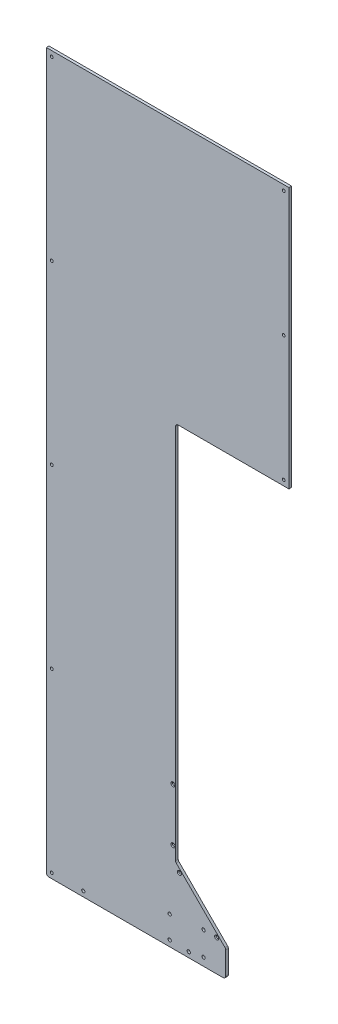
ISO-10303-21;
HEADER;
FILE_DESCRIPTION(('STEP AP214'),'2;1');
FILE_NAME('part.step','',(''),(''),'','','');
FILE_SCHEMA(('AUTOMOTIVE_DESIGN { 1 0 10303 214 1 1 1 1 }'));
ENDSEC;
DATA;
#1=APPLICATION_CONTEXT('core data for automotive mechanical design processes');
#2=APPLICATION_PROTOCOL_DEFINITION('international standard','automotive_design',2000,#1);
#3=PRODUCT_CONTEXT('',#1,'mechanical');
#4=PRODUCT('Part','Part','',(#3));
#5=PRODUCT_RELATED_PRODUCT_CATEGORY('part','',(#4));
#6=PRODUCT_DEFINITION_FORMATION('','',#4);
#7=PRODUCT_DEFINITION_CONTEXT('part definition',#1,'design');
#8=PRODUCT_DEFINITION('design','',#6,#7);
#9=PRODUCT_DEFINITION_SHAPE('','',#8);
#10=(LENGTH_UNIT() NAMED_UNIT(*) SI_UNIT(.MILLI.,.METRE.));
#11=(NAMED_UNIT(*) PLANE_ANGLE_UNIT() SI_UNIT($,.RADIAN.));
#12=(NAMED_UNIT(*) SI_UNIT($,.STERADIAN.) SOLID_ANGLE_UNIT());
#13=UNCERTAINTY_MEASURE_WITH_UNIT(LENGTH_MEASURE(1.E-05),#10,'distance_accuracy_value','');
#14=(GEOMETRIC_REPRESENTATION_CONTEXT(3) GLOBAL_UNCERTAINTY_ASSIGNED_CONTEXT((#13)) GLOBAL_UNIT_ASSIGNED_CONTEXT((#10,
#11,#12)) REPRESENTATION_CONTEXT('',''));
#15=CARTESIAN_POINT('',(0.,0.,0.));
#16=DIRECTION('',(0.,0.,1.));
#17=DIRECTION('',(1.,0.,0.));
#18=AXIS2_PLACEMENT_3D('',#15,#16,#17);
#19=CARTESIAN_POINT('',(0.,0.,6.35));
#20=DIRECTION('',(0.,0.,-1.));
#21=DIRECTION('',(-1.,0.,0.));
#22=AXIS2_PLACEMENT_3D('',#19,#20,#21);
#23=PLANE('',#22);
#24=CARTESIAN_POINT('',(296.8625,14.2875,6.35));
#25=DIRECTION('',(0.,0.,1.));
#26=DIRECTION('',(1.,0.,0.));
#27=AXIS2_PLACEMENT_3D('',#24,#25,#26);
#28=CIRCLE('',#27,3.96874999999997);
#29=CARTESIAN_POINT('',(300.83125,14.2875,6.35));
#30=VERTEX_POINT('',#29);
#31=EDGE_CURVE('E824',#30,#30,#28,.T.);
#32=ORIENTED_EDGE('',*,*,#31,.F.);
#33=EDGE_LOOP('',(#32));
#34=FACE_BOUND('',#33,.T.);
#35=CARTESIAN_POINT('',(378.46762,76.2,6.35));
#36=DIRECTION('',(0.,0.,-1.));
#37=DIRECTION('',(-1.,0.,0.));
#38=AXIS2_PLACEMENT_3D('',#35,#36,#37);
#39=CIRCLE('',#38,3.937);
#40=CARTESIAN_POINT('',(374.53062,76.2,6.35));
#41=VERTEX_POINT('',#40);
#42=EDGE_CURVE('E739',#41,#41,#39,.T.);
#43=ORIENTED_EDGE('',*,*,#42,.T.);
#44=EDGE_LOOP('',(#43));
#45=FACE_BOUND('',#44,.T.);
#46=CARTESIAN_POINT('',(378.46762,19.05,6.35));
#47=DIRECTION('',(0.,0.,-1.));
#48=DIRECTION('',(-1.,0.,0.));
#49=AXIS2_PLACEMENT_3D('',#46,#47,#48);
#50=CIRCLE('',#49,3.937);
#51=CARTESIAN_POINT('',(374.53062,19.05,6.35));
#52=VERTEX_POINT('',#51);
#53=EDGE_CURVE('E732',#52,#52,#50,.T.);
#54=ORIENTED_EDGE('',*,*,#53,.T.);
#55=EDGE_LOOP('',(#54));
#56=FACE_BOUND('',#55,.T.);
#57=CARTESIAN_POINT('',(304.8,342.9,6.35));
#58=DIRECTION('',(0.,0.,1.));
#59=DIRECTION('',(1.,0.,0.));
#60=AXIS2_PLACEMENT_3D('',#57,#58,#59);
#61=CIRCLE('',#60,4.88949999999999);
#62=CARTESIAN_POINT('',(309.6895,342.9,6.35));
#63=VERTEX_POINT('',#62);
#64=EDGE_CURVE('E742',#63,#63,#61,.T.);
#65=ORIENTED_EDGE('',*,*,#64,.F.);
#66=EDGE_LOOP('',(#65));
#67=FACE_BOUND('',#66,.T.);
#68=CARTESIAN_POINT('',(410.11974387893,76.2,6.35));
#69=DIRECTION('',(0.,0.,1.));
#70=DIRECTION('',(1.,0.,0.));
#71=AXIS2_PLACEMENT_3D('',#68,#69,#70);
#72=CIRCLE('',#71,4.88949999999999);
#73=CARTESIAN_POINT('',(415.00924387893,76.2,6.35));
#74=VERTEX_POINT('',#73);
#75=EDGE_CURVE('E766',#74,#74,#72,.T.);
#76=ORIENTED_EDGE('',*,*,#75,.F.);
#77=EDGE_LOOP('',(#76));
#78=FACE_BOUND('',#77,.T.);
#79=CARTESIAN_POINT('',(88.9,12.7,6.35));
#80=DIRECTION('',(0.,0.,1.));
#81=DIRECTION('',(1.,0.,0.));
#82=AXIS2_PLACEMENT_3D('',#79,#80,#81);
#83=CIRCLE('',#82,3.96875);
#84=CARTESIAN_POINT('',(92.86875,12.7,6.35));
#85=VERTEX_POINT('',#84);
#86=EDGE_CURVE('E211',#85,#85,#83,.T.);
#87=ORIENTED_EDGE('',*,*,#86,.F.);
#88=EDGE_LOOP('',(#87));
#89=FACE_BOUND('',#88,.T.);
#90=CARTESIAN_POINT('',(342.9,12.7,6.35));
#91=DIRECTION('',(0.,0.,1.));
#92=DIRECTION('',(1.,0.,0.));
#93=AXIS2_PLACEMENT_3D('',#90,#91,#92);
#94=CIRCLE('',#93,3.96875000000005);
#95=CARTESIAN_POINT('',(346.86875,12.7,6.35));
#96=VERTEX_POINT('',#95);
#97=EDGE_CURVE('E217',#96,#96,#94,.T.);
#98=ORIENTED_EDGE('',*,*,#97,.F.);
#99=EDGE_LOOP('',(#98));
#100=FACE_BOUND('',#99,.T.);
#101=CARTESIAN_POINT('',(12.7,1714.5,6.35));
#102=DIRECTION('',(0.,0.,1.));
#103=DIRECTION('',(1.,0.,0.));
#104=AXIS2_PLACEMENT_3D('',#101,#102,#103);
#105=CIRCLE('',#104,3.37819999999999);
#106=CARTESIAN_POINT('',(16.0782,1714.5,6.35));
#107=VERTEX_POINT('',#106);
#108=EDGE_CURVE('E215',#107,#107,#105,.T.);
#109=ORIENTED_EDGE('',*,*,#108,.F.);
#110=EDGE_LOOP('',(#109));
#111=FACE_BOUND('',#110,.T.);
#112=CARTESIAN_POINT('',(12.7,1289.05,6.35));
#113=DIRECTION('',(0.,0.,1.));
#114=DIRECTION('',(1.,0.,0.));
#115=AXIS2_PLACEMENT_3D('',#112,#113,#114);
#116=CIRCLE('',#115,3.37819999999999);
#117=CARTESIAN_POINT('',(16.0782,1289.05,6.35));
#118=VERTEX_POINT('',#117);
#119=EDGE_CURVE('E232',#118,#118,#116,.T.);
#120=ORIENTED_EDGE('',*,*,#119,.F.);
#121=EDGE_LOOP('',(#120));
#122=FACE_BOUND('',#121,.T.);
#123=CARTESIAN_POINT('',(12.7,863.6,6.35));
#124=DIRECTION('',(0.,0.,1.));
#125=DIRECTION('',(1.,0.,0.));
#126=AXIS2_PLACEMENT_3D('',#123,#124,#125);
#127=CIRCLE('',#126,3.37819999999999);
#128=CARTESIAN_POINT('',(16.0782,863.6,6.35));
#129=VERTEX_POINT('',#128);
#130=EDGE_CURVE('E238',#129,#129,#127,.T.);
#131=ORIENTED_EDGE('',*,*,#130,.F.);
#132=EDGE_LOOP('',(#131));
#133=FACE_BOUND('',#132,.T.);
#134=CARTESIAN_POINT('',(12.7,438.15,6.35));
#135=DIRECTION('',(0.,0.,1.));
#136=DIRECTION('',(1.,0.,0.));
#137=AXIS2_PLACEMENT_3D('',#134,#135,#136);
#138=CIRCLE('',#137,3.37819999999999);
#139=CARTESIAN_POINT('',(16.0782,438.15,6.35));
#140=VERTEX_POINT('',#139);
#141=EDGE_CURVE('E244',#140,#140,#138,.T.);
#142=ORIENTED_EDGE('',*,*,#141,.F.);
#143=EDGE_LOOP('',(#142));
#144=FACE_BOUND('',#143,.T.);
#145=CARTESIAN_POINT('',(12.7,12.7,6.35));
#146=DIRECTION('',(0.,0.,1.));
#147=DIRECTION('',(1.,0.,0.));
#148=AXIS2_PLACEMENT_3D('',#145,#146,#147);
#149=CIRCLE('',#148,3.37819999999999);
#150=CARTESIAN_POINT('',(16.0782,12.7,6.35));
#151=VERTEX_POINT('',#150);
#152=EDGE_CURVE('E250',#151,#151,#149,.T.);
#153=ORIENTED_EDGE('',*,*,#152,.F.);
#154=EDGE_LOOP('',(#153));
#155=FACE_BOUND('',#154,.T.);
#156=CARTESIAN_POINT('',(571.5,1111.25,6.35));
#157=DIRECTION('',(0.,0.,1.));
#158=DIRECTION('',(1.,0.,0.));
#159=AXIS2_PLACEMENT_3D('',#156,#157,#158);
#160=CIRCLE('',#159,3.3782);
#161=CARTESIAN_POINT('',(574.8782,1111.25,6.35));
#162=VERTEX_POINT('',#161);
#163=EDGE_CURVE('E256',#162,#162,#160,.T.);
#164=ORIENTED_EDGE('',*,*,#163,.F.);
#165=EDGE_LOOP('',(#164));
#166=FACE_BOUND('',#165,.T.);
#167=CARTESIAN_POINT('',(571.5,1412.875,6.35));
#168=DIRECTION('',(0.,0.,1.));
#169=DIRECTION('',(1.,0.,0.));
#170=AXIS2_PLACEMENT_3D('',#167,#168,#169);
#171=CIRCLE('',#170,3.3782);
#172=CARTESIAN_POINT('',(574.8782,1412.875,6.35));
#173=VERTEX_POINT('',#172);
#174=EDGE_CURVE('E262',#173,#173,#171,.T.);
#175=ORIENTED_EDGE('',*,*,#174,.F.);
#176=EDGE_LOOP('',(#175));
#177=FACE_BOUND('',#176,.T.);
#178=CARTESIAN_POINT('',(571.5,1714.5,6.35));
#179=DIRECTION('',(0.,0.,1.));
#180=DIRECTION('',(1.,0.,0.));
#181=AXIS2_PLACEMENT_3D('',#178,#179,#180);
#182=CIRCLE('',#181,3.3782);
#183=CARTESIAN_POINT('',(574.8782,1714.5,6.35));
#184=VERTEX_POINT('',#183);
#185=EDGE_CURVE('E268',#184,#184,#182,.T.);
#186=ORIENTED_EDGE('',*,*,#185,.F.);
#187=EDGE_LOOP('',(#186));
#188=FACE_BOUND('',#187,.T.);
#189=DIRECTION('',(0.,-1.,0.));
#190=VECTOR('',#189,1.);
#191=CARTESIAN_POINT('',(0.,0.,6.35));
#192=LINE('',#191,#190);
#193=CARTESIAN_POINT('',(0.,1727.2,6.35));
#194=VERTEX_POINT('',#193);
#195=CARTESIAN_POINT('',(0.,6.35,6.35));
#196=VERTEX_POINT('',#195);
#197=EDGE_CURVE('E158',#194,#196,#192,.T.);
#198=ORIENTED_EDGE('',*,*,#197,.T.);
#199=CARTESIAN_POINT('',(6.35,6.35,6.35));
#200=DIRECTION('',(0.,0.,-1.));
#201=DIRECTION('',(-1.,0.,0.));
#202=AXIS2_PLACEMENT_3D('',#199,#200,#201);
#203=CIRCLE('',#202,6.35);
#204=CARTESIAN_POINT('',(6.35,0.,6.35));
#205=VERTEX_POINT('',#204);
#206=EDGE_CURVE('E188',#196,#205,#203,.F.);
#207=ORIENTED_EDGE('',*,*,#206,.T.);
#208=DIRECTION('',(1.,0.,0.));
#209=VECTOR('',#208,1.);
#210=CARTESIAN_POINT('',(0.,0.,6.35));
#211=LINE('',#210,#209);
#212=CARTESIAN_POINT('',(425.45,0.,6.35));
#213=VERTEX_POINT('',#212);
#214=EDGE_CURVE('E292',#205,#213,#211,.T.);
#215=ORIENTED_EDGE('',*,*,#214,.T.);
#216=CARTESIAN_POINT('',(425.45,6.35,6.35));
#217=DIRECTION('',(0.,0.,-1.));
#218=DIRECTION('',(-1.,0.,0.));
#219=AXIS2_PLACEMENT_3D('',#216,#217,#218);
#220=CIRCLE('',#219,6.35);
#221=CARTESIAN_POINT('',(431.8,6.35,6.35));
#222=VERTEX_POINT('',#221);
#223=EDGE_CURVE('E186',#213,#222,#220,.F.);
#224=ORIENTED_EDGE('',*,*,#223,.T.);
#225=DIRECTION('',(0.,-1.,0.));
#226=VECTOR('',#225,1.);
#227=CARTESIAN_POINT('',(431.8,63.5,6.35));
#228=LINE('',#227,#226);
#229=CARTESIAN_POINT('',(431.8,60.8697438789308,6.35));
#230=VERTEX_POINT('',#229);
#231=EDGE_CURVE('E138',#230,#222,#228,.T.);
#232=ORIENTED_EDGE('',*,*,#231,.F.);
#233=CARTESIAN_POINT('',(425.45,60.8697438789308,6.35));
#234=DIRECTION('',(0.,0.,-1.));
#235=DIRECTION('',(-1.,0.,0.));
#236=AXIS2_PLACEMENT_3D('',#233,#234,#235);
#237=CIRCLE('',#236,6.35);
#238=CARTESIAN_POINT('',(429.940128060535,65.3598719394654,6.35));
#239=VERTEX_POINT('',#238);
#240=EDGE_CURVE('E184',#230,#239,#237,.F.);
#241=ORIENTED_EDGE('',*,*,#240,.T.);
#242=DIRECTION('',(0.70710678118655,-0.707106781186545,0.));
#243=VECTOR('',#242,1.);
#244=CARTESIAN_POINT('',(311.15,184.149999999999,6.35));
#245=LINE('',#244,#243);
#246=CARTESIAN_POINT('',(313.009871939466,182.290128060534,6.35));
#247=VERTEX_POINT('',#246);
#248=EDGE_CURVE('E285',#247,#239,#245,.T.);
#249=ORIENTED_EDGE('',*,*,#248,.F.);
#250=CARTESIAN_POINT('',(317.5,186.780256121068,6.35));
#251=DIRECTION('',(0.,0.,-1.));
#252=DIRECTION('',(-1.,0.,0.));
#253=AXIS2_PLACEMENT_3D('',#250,#251,#252);
#254=CIRCLE('',#253,6.35);
#255=CARTESIAN_POINT('',(311.15,186.780256121068,6.35));
#256=VERTEX_POINT('',#255);
#257=EDGE_CURVE('E56',#247,#256,#254,.T.);
#258=ORIENTED_EDGE('',*,*,#257,.T.);
#259=DIRECTION('',(0.,-1.,0.));
#260=VECTOR('',#259,1.);
#261=CARTESIAN_POINT('',(311.15,1098.55,6.35));
#262=LINE('',#261,#260);
#263=CARTESIAN_POINT('',(311.15,1092.2,6.35));
#264=VERTEX_POINT('',#263);
#265=EDGE_CURVE('E283',#264,#256,#262,.T.);
#266=ORIENTED_EDGE('',*,*,#265,.F.);
#267=CARTESIAN_POINT('',(317.5,1092.2,6.35));
#268=DIRECTION('',(0.,0.,-1.));
#269=DIRECTION('',(-1.,0.,0.));
#270=AXIS2_PLACEMENT_3D('',#267,#268,#269);
#271=CIRCLE('',#270,6.35);
#272=CARTESIAN_POINT('',(317.5,1098.55,6.35));
#273=VERTEX_POINT('',#272);
#274=EDGE_CURVE('E43',#264,#273,#271,.T.);
#275=ORIENTED_EDGE('',*,*,#274,.T.);
#276=DIRECTION('',(-1.,0.,0.));
#277=VECTOR('',#276,1.);
#278=CARTESIAN_POINT('',(584.2,1098.55,6.35));
#279=LINE('',#278,#277);
#280=CARTESIAN_POINT('',(584.2,1098.55,6.35));
#281=VERTEX_POINT('',#280);
#282=EDGE_CURVE('E273',#281,#273,#279,.T.);
#283=ORIENTED_EDGE('',*,*,#282,.F.);
#284=DIRECTION('',(0.,1.,0.));
#285=VECTOR('',#284,1.);
#286=CARTESIAN_POINT('',(584.2,0.,6.35));
#287=LINE('',#286,#285);
#288=CARTESIAN_POINT('',(584.2,1727.2,6.35));
#289=VERTEX_POINT('',#288);
#290=EDGE_CURVE('E146',#281,#289,#287,.T.);
#291=ORIENTED_EDGE('',*,*,#290,.T.);
#292=DIRECTION('',(-1.,0.,0.));
#293=VECTOR('',#292,1.);
#294=CARTESIAN_POINT('',(0.,1727.2,6.35));
#295=LINE('',#294,#293);
#296=EDGE_CURVE('E168',#289,#194,#295,.T.);
#297=ORIENTED_EDGE('',*,*,#296,.T.);
#298=EDGE_LOOP('',(#198,#207,#215,#224,#232,#241,#249,#258,#266,#275,#283,#291,#297));
#299=FACE_BOUND('',#298,.T.);
#300=CARTESIAN_POINT('',(320.317182668239,166.002561210692,6.35));
#301=DIRECTION('',(0.,0.,1.));
#302=DIRECTION('',(1.,0.,0.));
#303=AXIS2_PLACEMENT_3D('',#300,#301,#302);
#304=CIRCLE('',#303,4.88949999999999);
#305=CARTESIAN_POINT('',(325.206682668239,166.002561210692,6.35));
#306=VERTEX_POINT('',#305);
#307=EDGE_CURVE('E759',#306,#306,#304,.T.);
#308=ORIENTED_EDGE('',*,*,#307,.F.);
#309=EDGE_LOOP('',(#308));
#310=FACE_BOUND('',#309,.T.);
#311=CARTESIAN_POINT('',(304.8,215.9,6.35));
#312=DIRECTION('',(0.,0.,1.));
#313=DIRECTION('',(1.,0.,0.));
#314=AXIS2_PLACEMENT_3D('',#311,#312,#313);
#315=CIRCLE('',#314,4.88949999999999);
#316=CARTESIAN_POINT('',(309.6895,215.9,6.35));
#317=VERTEX_POINT('',#316);
#318=EDGE_CURVE('E752',#317,#317,#315,.T.);
#319=ORIENTED_EDGE('',*,*,#318,.F.);
#320=EDGE_LOOP('',(#319));
#321=FACE_BOUND('',#320,.T.);
#322=CARTESIAN_POINT('',(296.8625,68.2625,6.35));
#323=DIRECTION('',(0.,0.,1.));
#324=DIRECTION('',(1.,0.,0.));
#325=AXIS2_PLACEMENT_3D('',#322,#323,#324);
#326=CIRCLE('',#325,3.96874999999997);
#327=CARTESIAN_POINT('',(300.83125,68.2625,6.35));
#328=VERTEX_POINT('',#327);
#329=EDGE_CURVE('E730',#328,#328,#326,.T.);
#330=ORIENTED_EDGE('',*,*,#329,.F.);
#331=EDGE_LOOP('',(#330));
#332=FACE_BOUND('',#331,.T.);
#333=ADVANCED_FACE('F34',(#34,#45,#56,#67,#78,#89,#100,#111,#122,#133,#144,#155,#166,#177,#188,
#299,#310,#321,#332),#23,.F.);
#334=CARTESIAN_POINT('',(0.,0.,0.));
#335=DIRECTION('',(0.,0.,-1.));
#336=DIRECTION('',(-1.,0.,0.));
#337=AXIS2_PLACEMENT_3D('',#334,#335,#336);
#338=PLANE('',#337);
#339=CARTESIAN_POINT('',(296.8625,14.2875,0.));
#340=DIRECTION('',(0.,0.,1.));
#341=DIRECTION('',(1.,0.,0.));
#342=AXIS2_PLACEMENT_3D('',#339,#340,#341);
#343=CIRCLE('',#342,3.96874999999997);
#344=CARTESIAN_POINT('',(300.83125,14.2875,0.));
#345=VERTEX_POINT('',#344);
#346=EDGE_CURVE('E735',#345,#345,#343,.T.);
#347=ORIENTED_EDGE('',*,*,#346,.T.);
#348=EDGE_LOOP('',(#347));
#349=FACE_BOUND('',#348,.T.);
#350=DIRECTION('',(1.,0.,0.));
#351=VECTOR('',#350,1.);
#352=CARTESIAN_POINT('',(0.,0.,0.));
#353=LINE('',#352,#351);
#354=CARTESIAN_POINT('',(6.35,0.,0.));
#355=VERTEX_POINT('',#354);
#356=CARTESIAN_POINT('',(425.45,0.,0.));
#357=VERTEX_POINT('',#356);
#358=EDGE_CURVE('E156',#355,#357,#353,.T.);
#359=ORIENTED_EDGE('',*,*,#358,.F.);
#360=CARTESIAN_POINT('',(6.35,6.35,0.));
#361=DIRECTION('',(0.,0.,-1.));
#362=DIRECTION('',(-1.,0.,0.));
#363=AXIS2_PLACEMENT_3D('',#360,#361,#362);
#364=CIRCLE('',#363,6.35);
#365=CARTESIAN_POINT('',(0.,6.35,0.));
#366=VERTEX_POINT('',#365);
#367=EDGE_CURVE('E180',#355,#366,#364,.T.);
#368=ORIENTED_EDGE('',*,*,#367,.T.);
#369=DIRECTION('',(0.,-1.,0.));
#370=VECTOR('',#369,1.);
#371=CARTESIAN_POINT('',(0.,0.,0.));
#372=LINE('',#371,#370);
#373=CARTESIAN_POINT('',(0.,1727.2,0.));
#374=VERTEX_POINT('',#373);
#375=EDGE_CURVE('E147',#374,#366,#372,.T.);
#376=ORIENTED_EDGE('',*,*,#375,.F.);
#377=DIRECTION('',(-1.,0.,0.));
#378=VECTOR('',#377,1.);
#379=CARTESIAN_POINT('',(0.,1727.2,0.));
#380=LINE('',#379,#378);
#381=CARTESIAN_POINT('',(584.2,1727.2,0.));
#382=VERTEX_POINT('',#381);
#383=EDGE_CURVE('E155',#382,#374,#380,.T.);
#384=ORIENTED_EDGE('',*,*,#383,.F.);
#385=DIRECTION('',(0.,1.,0.));
#386=VECTOR('',#385,1.);
#387=CARTESIAN_POINT('',(584.2,0.,0.));
#388=LINE('',#387,#386);
#389=CARTESIAN_POINT('',(584.2,1098.55,0.));
#390=VERTEX_POINT('',#389);
#391=EDGE_CURVE('E144',#390,#382,#388,.T.);
#392=ORIENTED_EDGE('',*,*,#391,.F.);
#393=DIRECTION('',(-1.,0.,0.));
#394=VECTOR('',#393,1.);
#395=CARTESIAN_POINT('',(584.2,1098.55,0.));
#396=LINE('',#395,#394);
#397=CARTESIAN_POINT('',(317.5,1098.55,0.));
#398=VERTEX_POINT('',#397);
#399=EDGE_CURVE('E128',#390,#398,#396,.T.);
#400=ORIENTED_EDGE('',*,*,#399,.T.);
#401=CARTESIAN_POINT('',(317.5,1092.2,0.));
#402=DIRECTION('',(0.,0.,-1.));
#403=DIRECTION('',(-1.,0.,0.));
#404=AXIS2_PLACEMENT_3D('',#401,#402,#403);
#405=CIRCLE('',#404,6.35);
#406=CARTESIAN_POINT('',(311.15,1092.2,0.));
#407=VERTEX_POINT('',#406);
#408=EDGE_CURVE('E11',#398,#407,#405,.F.);
#409=ORIENTED_EDGE('',*,*,#408,.T.);
#410=DIRECTION('',(0.,-1.,0.));
#411=VECTOR('',#410,1.);
#412=CARTESIAN_POINT('',(311.15,1098.55,0.));
#413=LINE('',#412,#411);
#414=CARTESIAN_POINT('',(311.15,186.780256121068,0.));
#415=VERTEX_POINT('',#414);
#416=EDGE_CURVE('E137',#407,#415,#413,.T.);
#417=ORIENTED_EDGE('',*,*,#416,.T.);
#418=CARTESIAN_POINT('',(317.5,186.780256121068,0.));
#419=DIRECTION('',(0.,0.,-1.));
#420=DIRECTION('',(-1.,0.,0.));
#421=AXIS2_PLACEMENT_3D('',#418,#419,#420);
#422=CIRCLE('',#421,6.35);
#423=CARTESIAN_POINT('',(313.009871939466,182.290128060534,0.));
#424=VERTEX_POINT('',#423);
#425=EDGE_CURVE('E207',#415,#424,#422,.F.);
#426=ORIENTED_EDGE('',*,*,#425,.T.);
#427=DIRECTION('',(0.70710678118655,-0.707106781186545,0.));
#428=VECTOR('',#427,1.);
#429=CARTESIAN_POINT('',(311.15,184.149999999999,0.));
#430=LINE('',#429,#428);
#431=CARTESIAN_POINT('',(429.940128060535,65.3598719394654,0.));
#432=VERTEX_POINT('',#431);
#433=EDGE_CURVE('E277',#424,#432,#430,.T.);
#434=ORIENTED_EDGE('',*,*,#433,.T.);
#435=CARTESIAN_POINT('',(425.45,60.8697438789308,0.));
#436=DIRECTION('',(0.,0.,-1.));
#437=DIRECTION('',(-1.,0.,0.));
#438=AXIS2_PLACEMENT_3D('',#435,#436,#437);
#439=CIRCLE('',#438,6.35);
#440=CARTESIAN_POINT('',(431.8,60.8697438789308,0.));
#441=VERTEX_POINT('',#440);
#442=EDGE_CURVE('E176',#432,#441,#439,.T.);
#443=ORIENTED_EDGE('',*,*,#442,.T.);
#444=DIRECTION('',(0.,-1.,0.));
#445=VECTOR('',#444,1.);
#446=CARTESIAN_POINT('',(431.8,63.5,0.));
#447=LINE('',#446,#445);
#448=CARTESIAN_POINT('',(431.8,6.35,0.));
#449=VERTEX_POINT('',#448);
#450=EDGE_CURVE('E148',#441,#449,#447,.T.);
#451=ORIENTED_EDGE('',*,*,#450,.T.);
#452=CARTESIAN_POINT('',(425.45,6.35,0.));
#453=DIRECTION('',(0.,0.,-1.));
#454=DIRECTION('',(-1.,0.,0.));
#455=AXIS2_PLACEMENT_3D('',#452,#453,#454);
#456=CIRCLE('',#455,6.35);
#457=EDGE_CURVE('E178',#449,#357,#456,.T.);
#458=ORIENTED_EDGE('',*,*,#457,.T.);
#459=EDGE_LOOP('',(#359,#368,#376,#384,#392,#400,#409,#417,#426,#434,#443,#451,#458));
#460=FACE_BOUND('',#459,.T.);
#461=CARTESIAN_POINT('',(571.5,1714.5,0.));
#462=DIRECTION('',(0.,0.,1.));
#463=DIRECTION('',(1.,0.,0.));
#464=AXIS2_PLACEMENT_3D('',#461,#462,#463);
#465=CIRCLE('',#464,3.3782);
#466=CARTESIAN_POINT('',(574.8782,1714.5,0.));
#467=VERTEX_POINT('',#466);
#468=EDGE_CURVE('E271',#467,#467,#465,.T.);
#469=ORIENTED_EDGE('',*,*,#468,.T.);
#470=EDGE_LOOP('',(#469));
#471=FACE_BOUND('',#470,.T.);
#472=CARTESIAN_POINT('',(571.5,1412.875,0.));
#473=DIRECTION('',(0.,0.,1.));
#474=DIRECTION('',(1.,0.,0.));
#475=AXIS2_PLACEMENT_3D('',#472,#473,#474);
#476=CIRCLE('',#475,3.3782);
#477=CARTESIAN_POINT('',(574.8782,1412.875,0.));
#478=VERTEX_POINT('',#477);
#479=EDGE_CURVE('E265',#478,#478,#476,.T.);
#480=ORIENTED_EDGE('',*,*,#479,.T.);
#481=EDGE_LOOP('',(#480));
#482=FACE_BOUND('',#481,.T.);
#483=CARTESIAN_POINT('',(571.5,1111.25,0.));
#484=DIRECTION('',(0.,0.,1.));
#485=DIRECTION('',(1.,0.,0.));
#486=AXIS2_PLACEMENT_3D('',#483,#484,#485);
#487=CIRCLE('',#486,3.3782);
#488=CARTESIAN_POINT('',(574.8782,1111.25,0.));
#489=VERTEX_POINT('',#488);
#490=EDGE_CURVE('E259',#489,#489,#487,.T.);
#491=ORIENTED_EDGE('',*,*,#490,.T.);
#492=EDGE_LOOP('',(#491));
#493=FACE_BOUND('',#492,.T.);
#494=CARTESIAN_POINT('',(12.7,12.7,0.));
#495=DIRECTION('',(0.,0.,1.));
#496=DIRECTION('',(1.,0.,0.));
#497=AXIS2_PLACEMENT_3D('',#494,#495,#496);
#498=CIRCLE('',#497,3.37819999999999);
#499=CARTESIAN_POINT('',(16.0782,12.7,0.));
#500=VERTEX_POINT('',#499);
#501=EDGE_CURVE('E253',#500,#500,#498,.T.);
#502=ORIENTED_EDGE('',*,*,#501,.T.);
#503=EDGE_LOOP('',(#502));
#504=FACE_BOUND('',#503,.T.);
#505=CARTESIAN_POINT('',(12.7,438.15,0.));
#506=DIRECTION('',(0.,0.,1.));
#507=DIRECTION('',(1.,0.,0.));
#508=AXIS2_PLACEMENT_3D('',#505,#506,#507);
#509=CIRCLE('',#508,3.37819999999999);
#510=CARTESIAN_POINT('',(16.0782,438.15,0.));
#511=VERTEX_POINT('',#510);
#512=EDGE_CURVE('E247',#511,#511,#509,.T.);
#513=ORIENTED_EDGE('',*,*,#512,.T.);
#514=EDGE_LOOP('',(#513));
#515=FACE_BOUND('',#514,.T.);
#516=CARTESIAN_POINT('',(12.7,863.6,0.));
#517=DIRECTION('',(0.,0.,1.));
#518=DIRECTION('',(1.,0.,0.));
#519=AXIS2_PLACEMENT_3D('',#516,#517,#518);
#520=CIRCLE('',#519,3.37819999999999);
#521=CARTESIAN_POINT('',(16.0782,863.6,0.));
#522=VERTEX_POINT('',#521);
#523=EDGE_CURVE('E241',#522,#522,#520,.T.);
#524=ORIENTED_EDGE('',*,*,#523,.T.);
#525=EDGE_LOOP('',(#524));
#526=FACE_BOUND('',#525,.T.);
#527=CARTESIAN_POINT('',(12.7,1289.05,0.));
#528=DIRECTION('',(0.,0.,1.));
#529=DIRECTION('',(1.,0.,0.));
#530=AXIS2_PLACEMENT_3D('',#527,#528,#529);
#531=CIRCLE('',#530,3.37819999999999);
#532=CARTESIAN_POINT('',(16.0782,1289.05,0.));
#533=VERTEX_POINT('',#532);
#534=EDGE_CURVE('E235',#533,#533,#531,.T.);
#535=ORIENTED_EDGE('',*,*,#534,.T.);
#536=EDGE_LOOP('',(#535));
#537=FACE_BOUND('',#536,.T.);
#538=CARTESIAN_POINT('',(12.7,1714.5,0.));
#539=DIRECTION('',(0.,0.,1.));
#540=DIRECTION('',(1.,0.,0.));
#541=AXIS2_PLACEMENT_3D('',#538,#539,#540);
#542=CIRCLE('',#541,3.37819999999999);
#543=CARTESIAN_POINT('',(16.0782,1714.5,0.));
#544=VERTEX_POINT('',#543);
#545=EDGE_CURVE('E229',#544,#544,#542,.T.);
#546=ORIENTED_EDGE('',*,*,#545,.T.);
#547=EDGE_LOOP('',(#546));
#548=FACE_BOUND('',#547,.T.);
#549=CARTESIAN_POINT('',(342.9,12.7,0.));
#550=DIRECTION('',(0.,0.,-1.));
#551=DIRECTION('',(-1.,0.,0.));
#552=AXIS2_PLACEMENT_3D('',#549,#550,#551);
#553=CIRCLE('',#552,3.96875000000005);
#554=CARTESIAN_POINT('',(338.93125,12.7,0.));
#555=VERTEX_POINT('',#554);
#556=EDGE_CURVE('E209',#555,#555,#553,.T.);
#557=ORIENTED_EDGE('',*,*,#556,.F.);
#558=EDGE_LOOP('',(#557));
#559=FACE_BOUND('',#558,.T.);
#560=CARTESIAN_POINT('',(88.9,12.7,0.));
#561=DIRECTION('',(0.,0.,-1.));
#562=DIRECTION('',(-1.,0.,0.));
#563=AXIS2_PLACEMENT_3D('',#560,#561,#562);
#564=CIRCLE('',#563,3.96875);
#565=CARTESIAN_POINT('',(84.93125,12.7,0.));
#566=VERTEX_POINT('',#565);
#567=EDGE_CURVE('E38',#566,#566,#564,.T.);
#568=ORIENTED_EDGE('',*,*,#567,.F.);
#569=EDGE_LOOP('',(#568));
#570=FACE_BOUND('',#569,.T.);
#571=CARTESIAN_POINT('',(410.11974387893,76.2,0.));
#572=DIRECTION('',(0.,0.,-1.));
#573=DIRECTION('',(-1.,0.,0.));
#574=AXIS2_PLACEMENT_3D('',#571,#572,#573);
#575=CIRCLE('',#574,2.8067);
#576=CARTESIAN_POINT('',(407.31304387893,76.2,0.));
#577=VERTEX_POINT('',#576);
#578=EDGE_CURVE('E222',#577,#577,#575,.T.);
#579=ORIENTED_EDGE('',*,*,#578,.F.);
#580=EDGE_LOOP('',(#579));
#581=FACE_BOUND('',#580,.T.);
#582=CARTESIAN_POINT('',(320.317182668239,166.002561210692,0.));
#583=DIRECTION('',(0.,0.,-1.));
#584=DIRECTION('',(-1.,0.,0.));
#585=AXIS2_PLACEMENT_3D('',#582,#583,#584);
#586=CIRCLE('',#585,2.8067);
#587=CARTESIAN_POINT('',(317.510482668239,166.002561210692,0.));
#588=VERTEX_POINT('',#587);
#589=EDGE_CURVE('E710',#588,#588,#586,.T.);
#590=ORIENTED_EDGE('',*,*,#589,.F.);
#591=EDGE_LOOP('',(#590));
#592=FACE_BOUND('',#591,.T.);
#593=CARTESIAN_POINT('',(304.8,215.9,0.));
#594=DIRECTION('',(0.,0.,-1.));
#595=DIRECTION('',(-1.,0.,0.));
#596=AXIS2_PLACEMENT_3D('',#593,#594,#595);
#597=CIRCLE('',#596,2.8067);
#598=CARTESIAN_POINT('',(301.9933,215.9,0.));
#599=VERTEX_POINT('',#598);
#600=EDGE_CURVE('E714',#599,#599,#597,.T.);
#601=ORIENTED_EDGE('',*,*,#600,.F.);
#602=EDGE_LOOP('',(#601));
#603=FACE_BOUND('',#602,.T.);
#604=CARTESIAN_POINT('',(304.8,342.9,0.));
#605=DIRECTION('',(0.,0.,-1.));
#606=DIRECTION('',(-1.,0.,0.));
#607=AXIS2_PLACEMENT_3D('',#604,#605,#606);
#608=CIRCLE('',#607,2.8067);
#609=CARTESIAN_POINT('',(301.9933,342.9,0.));
#610=VERTEX_POINT('',#609);
#611=EDGE_CURVE('E718',#610,#610,#608,.T.);
#612=ORIENTED_EDGE('',*,*,#611,.F.);
#613=EDGE_LOOP('',(#612));
#614=FACE_BOUND('',#613,.T.);
#615=CARTESIAN_POINT('',(378.46762,19.05,0.));
#616=DIRECTION('',(0.,0.,-1.));
#617=DIRECTION('',(-1.,0.,0.));
#618=AXIS2_PLACEMENT_3D('',#615,#616,#617);
#619=CIRCLE('',#618,3.937);
#620=CARTESIAN_POINT('',(374.53062,19.05,0.));
#621=VERTEX_POINT('',#620);
#622=EDGE_CURVE('E722',#621,#621,#619,.T.);
#623=ORIENTED_EDGE('',*,*,#622,.F.);
#624=EDGE_LOOP('',(#623));
#625=FACE_BOUND('',#624,.T.);
#626=CARTESIAN_POINT('',(378.46762,76.2,0.));
#627=DIRECTION('',(0.,0.,-1.));
#628=DIRECTION('',(-1.,0.,0.));
#629=AXIS2_PLACEMENT_3D('',#626,#627,#628);
#630=CIRCLE('',#629,3.937);
#631=CARTESIAN_POINT('',(374.53062,76.2,0.));
#632=VERTEX_POINT('',#631);
#633=EDGE_CURVE('E726',#632,#632,#630,.T.);
#634=ORIENTED_EDGE('',*,*,#633,.F.);
#635=EDGE_LOOP('',(#634));
#636=FACE_BOUND('',#635,.T.);
#637=CARTESIAN_POINT('',(296.8625,68.2625,0.));
#638=DIRECTION('',(0.,0.,1.));
#639=DIRECTION('',(1.,0.,0.));
#640=AXIS2_PLACEMENT_3D('',#637,#638,#639);
#641=CIRCLE('',#640,3.96874999999997);
#642=CARTESIAN_POINT('',(300.83125,68.2625,0.));
#643=VERTEX_POINT('',#642);
#644=EDGE_CURVE('E729',#643,#643,#641,.T.);
#645=ORIENTED_EDGE('',*,*,#644,.T.);
#646=EDGE_LOOP('',(#645));
#647=FACE_BOUND('',#646,.T.);
#648=ADVANCED_FACE('F152',(#349,#460,#471,#482,#493,#504,#515,#526,#537,#548,#559,#570,#581,
#592,#603,#614,#625,#636,#647),#338,.T.);
#649=CARTESIAN_POINT('',(0.,0.,6.35));
#650=DIRECTION('',(1.,0.,0.));
#651=DIRECTION('',(0.,0.,-1.));
#652=AXIS2_PLACEMENT_3D('',#649,#650,#651);
#653=PLANE('',#652);
#654=ORIENTED_EDGE('',*,*,#375,.T.);
#655=DIRECTION('',(0.,0.,-1.));
#656=VECTOR('',#655,1.);
#657=CARTESIAN_POINT('',(0.,6.35,6.35));
#658=LINE('',#657,#656);
#659=EDGE_CURVE('E182',#366,#196,#658,.F.);
#660=ORIENTED_EDGE('',*,*,#659,.T.);
#661=ORIENTED_EDGE('',*,*,#197,.F.);
#662=DIRECTION('',(0.,0.,-1.));
#663=VECTOR('',#662,1.);
#664=CARTESIAN_POINT('',(0.,1727.2,6.35));
#665=LINE('',#664,#663);
#666=EDGE_CURVE('E164',#194,#374,#665,.T.);
#667=ORIENTED_EDGE('',*,*,#666,.T.);
#668=EDGE_LOOP('',(#654,#660,#661,#667));
#669=FACE_BOUND('',#668,.T.);
#670=ADVANCED_FACE('F299',(#669),#653,.F.);
#671=CARTESIAN_POINT('',(0.,0.,6.35));
#672=DIRECTION('',(0.,1.,0.));
#673=DIRECTION('',(0.,0.,1.));
#674=AXIS2_PLACEMENT_3D('',#671,#672,#673);
#675=PLANE('',#674);
#676=ORIENTED_EDGE('',*,*,#214,.F.);
#677=DIRECTION('',(0.,0.,-1.));
#678=VECTOR('',#677,1.);
#679=CARTESIAN_POINT('',(6.35,0.,6.35));
#680=LINE('',#679,#678);
#681=EDGE_CURVE('E173',#205,#355,#680,.T.);
#682=ORIENTED_EDGE('',*,*,#681,.T.);
#683=ORIENTED_EDGE('',*,*,#358,.T.);
#684=DIRECTION('',(0.,0.,1.));
#685=VECTOR('',#684,1.);
#686=CARTESIAN_POINT('',(425.45,0.,6.35));
#687=LINE('',#686,#685);
#688=EDGE_CURVE('E170',#357,#213,#687,.T.);
#689=ORIENTED_EDGE('',*,*,#688,.T.);
#690=EDGE_LOOP('',(#676,#682,#683,#689));
#691=FACE_BOUND('',#690,.T.);
#692=ADVANCED_FACE('F309',(#691),#675,.F.);
#693=CARTESIAN_POINT('',(584.2,0.,6.35));
#694=DIRECTION('',(-1.,0.,0.));
#695=DIRECTION('',(0.,0.,1.));
#696=AXIS2_PLACEMENT_3D('',#693,#694,#695);
#697=PLANE('',#696);
#698=ORIENTED_EDGE('',*,*,#290,.F.);
#699=DIRECTION('',(0.,0.,1.));
#700=VECTOR('',#699,1.);
#701=CARTESIAN_POINT('',(584.2,1098.55,0.));
#702=LINE('',#701,#700);
#703=EDGE_CURVE('E131',#390,#281,#702,.T.);
#704=ORIENTED_EDGE('',*,*,#703,.F.);
#705=ORIENTED_EDGE('',*,*,#391,.T.);
#706=DIRECTION('',(0.,0.,-1.));
#707=VECTOR('',#706,1.);
#708=CARTESIAN_POINT('',(584.2,1727.2,6.35));
#709=LINE('',#708,#707);
#710=EDGE_CURVE('E167',#289,#382,#709,.T.);
#711=ORIENTED_EDGE('',*,*,#710,.F.);
#712=EDGE_LOOP('',(#698,#704,#705,#711));
#713=FACE_BOUND('',#712,.T.);
#714=ADVANCED_FACE('F142',(#713),#697,.F.);
#715=CARTESIAN_POINT('',(0.,1727.2,6.35));
#716=DIRECTION('',(0.,-1.,0.));
#717=DIRECTION('',(0.,0.,-1.));
#718=AXIS2_PLACEMENT_3D('',#715,#716,#717);
#719=PLANE('',#718);
#720=ORIENTED_EDGE('',*,*,#383,.T.);
#721=ORIENTED_EDGE('',*,*,#666,.F.);
#722=ORIENTED_EDGE('',*,*,#296,.F.);
#723=ORIENTED_EDGE('',*,*,#710,.T.);
#724=EDGE_LOOP('',(#720,#721,#722,#723));
#725=FACE_BOUND('',#724,.T.);
#726=ADVANCED_FACE('F358',(#725),#719,.F.);
#727=CARTESIAN_POINT('',(431.8,63.5,0.));
#728=DIRECTION('',(-1.,0.,0.));
#729=DIRECTION('',(0.,0.,1.));
#730=AXIS2_PLACEMENT_3D('',#727,#728,#729);
#731=PLANE('',#730);
#732=ORIENTED_EDGE('',*,*,#231,.T.);
#733=DIRECTION('',(0.,0.,1.));
#734=VECTOR('',#733,1.);
#735=CARTESIAN_POINT('',(431.8,6.35,0.));
#736=LINE('',#735,#734);
#737=EDGE_CURVE('E193',#222,#449,#736,.F.);
#738=ORIENTED_EDGE('',*,*,#737,.T.);
#739=ORIENTED_EDGE('',*,*,#450,.F.);
#740=DIRECTION('',(0.,0.,1.));
#741=VECTOR('',#740,1.);
#742=CARTESIAN_POINT('',(431.8,60.8697438789308,0.));
#743=LINE('',#742,#741);
#744=EDGE_CURVE('E190',#441,#230,#743,.T.);
#745=ORIENTED_EDGE('',*,*,#744,.T.);
#746=EDGE_LOOP('',(#732,#738,#739,#745));
#747=FACE_BOUND('',#746,.T.);
#748=ADVANCED_FACE('F317',(#747),#731,.F.);
#749=CARTESIAN_POINT('',(311.15,184.149999999999,0.));
#750=DIRECTION('',(-0.707106781186545,-0.707106781186549,0.));
#751=DIRECTION('',(0.70710678118655,-0.707106781186545,0.));
#752=AXIS2_PLACEMENT_3D('',#749,#750,#751);
#753=PLANE('',#752);
#754=ORIENTED_EDGE('',*,*,#248,.T.);
#755=DIRECTION('',(0.,0.,1.));
#756=VECTOR('',#755,1.);
#757=CARTESIAN_POINT('',(429.940128060535,65.3598719394654,0.));
#758=LINE('',#757,#756);
#759=EDGE_CURVE('E198',#239,#432,#758,.F.);
#760=ORIENTED_EDGE('',*,*,#759,.T.);
#761=ORIENTED_EDGE('',*,*,#433,.F.);
#762=DIRECTION('',(0.,0.,1.));
#763=VECTOR('',#762,1.);
#764=CARTESIAN_POINT('',(313.009871939466,182.290128060534,6.35));
#765=LINE('',#764,#763);
#766=EDGE_CURVE('E195',#424,#247,#765,.T.);
#767=ORIENTED_EDGE('',*,*,#766,.T.);
#768=EDGE_LOOP('',(#754,#760,#761,#767));
#769=FACE_BOUND('',#768,.T.);
#770=ADVANCED_FACE('F325',(#769),#753,.F.);
#771=CARTESIAN_POINT('',(311.15,1098.55,0.));
#772=DIRECTION('',(-1.,0.,0.));
#773=DIRECTION('',(0.,-1.,0.));
#774=AXIS2_PLACEMENT_3D('',#771,#772,#773);
#775=PLANE('',#774);
#776=ORIENTED_EDGE('',*,*,#265,.T.);
#777=DIRECTION('',(0.,0.,1.));
#778=VECTOR('',#777,1.);
#779=CARTESIAN_POINT('',(311.15,186.780256121068,0.));
#780=LINE('',#779,#778);
#781=EDGE_CURVE('E203',#256,#415,#780,.F.);
#782=ORIENTED_EDGE('',*,*,#781,.T.);
#783=ORIENTED_EDGE('',*,*,#416,.F.);
#784=DIRECTION('',(0.,0.,1.));
#785=VECTOR('',#784,1.);
#786=CARTESIAN_POINT('',(311.15,1092.2,6.35));
#787=LINE('',#786,#785);
#788=EDGE_CURVE('E200',#407,#264,#787,.T.);
#789=ORIENTED_EDGE('',*,*,#788,.T.);
#790=EDGE_LOOP('',(#776,#782,#783,#789));
#791=FACE_BOUND('',#790,.T.);
#792=ADVANCED_FACE('F334',(#791),#775,.F.);
#793=CARTESIAN_POINT('',(584.2,1098.55,0.));
#794=DIRECTION('',(0.,1.,0.));
#795=DIRECTION('',(0.,0.,1.));
#796=AXIS2_PLACEMENT_3D('',#793,#794,#795);
#797=PLANE('',#796);
#798=ORIENTED_EDGE('',*,*,#282,.T.);
#799=DIRECTION('',(0.,0.,1.));
#800=VECTOR('',#799,1.);
#801=CARTESIAN_POINT('',(317.5,1098.55,0.));
#802=LINE('',#801,#800);
#803=EDGE_CURVE('E133',#273,#398,#802,.F.);
#804=ORIENTED_EDGE('',*,*,#803,.T.);
#805=ORIENTED_EDGE('',*,*,#399,.F.);
#806=ORIENTED_EDGE('',*,*,#703,.T.);
#807=EDGE_LOOP('',(#798,#804,#805,#806));
#808=FACE_BOUND('',#807,.T.);
#809=ADVANCED_FACE('F130',(#808),#797,.F.);
#810=CARTESIAN_POINT('',(571.5,1714.5,6.35));
#811=DIRECTION('',(0.,0.,1.));
#812=DIRECTION('',(1.,0.,0.));
#813=AXIS2_PLACEMENT_3D('',#810,#811,#812);
#814=CYLINDRICAL_SURFACE('',#813,3.3782);
#815=ORIENTED_EDGE('',*,*,#468,.F.);
#816=EDGE_LOOP('',(#815));
#817=FACE_BOUND('',#816,.T.);
#818=ORIENTED_EDGE('',*,*,#185,.T.);
#819=EDGE_LOOP('',(#818));
#820=FACE_BOUND('',#819,.T.);
#821=ADVANCED_FACE('F564',(#817,#820),#814,.F.);
#822=CARTESIAN_POINT('',(571.5,1412.875,6.35));
#823=DIRECTION('',(0.,0.,1.));
#824=DIRECTION('',(1.,0.,0.));
#825=AXIS2_PLACEMENT_3D('',#822,#823,#824);
#826=CYLINDRICAL_SURFACE('',#825,3.3782);
#827=ORIENTED_EDGE('',*,*,#479,.F.);
#828=EDGE_LOOP('',(#827));
#829=FACE_BOUND('',#828,.T.);
#830=ORIENTED_EDGE('',*,*,#174,.T.);
#831=EDGE_LOOP('',(#830));
#832=FACE_BOUND('',#831,.T.);
#833=ADVANCED_FACE('F560',(#829,#832),#826,.F.);
#834=CARTESIAN_POINT('',(571.5,1111.25,6.35));
#835=DIRECTION('',(0.,0.,1.));
#836=DIRECTION('',(1.,0.,0.));
#837=AXIS2_PLACEMENT_3D('',#834,#835,#836);
#838=CYLINDRICAL_SURFACE('',#837,3.3782);
#839=ORIENTED_EDGE('',*,*,#490,.F.);
#840=EDGE_LOOP('',(#839));
#841=FACE_BOUND('',#840,.T.);
#842=ORIENTED_EDGE('',*,*,#163,.T.);
#843=EDGE_LOOP('',(#842));
#844=FACE_BOUND('',#843,.T.);
#845=ADVANCED_FACE('F556',(#841,#844),#838,.F.);
#846=CARTESIAN_POINT('',(12.7,12.7,6.35));
#847=DIRECTION('',(0.,0.,1.));
#848=DIRECTION('',(1.,0.,0.));
#849=AXIS2_PLACEMENT_3D('',#846,#847,#848);
#850=CYLINDRICAL_SURFACE('',#849,3.37819999999999);
#851=ORIENTED_EDGE('',*,*,#501,.F.);
#852=EDGE_LOOP('',(#851));
#853=FACE_BOUND('',#852,.T.);
#854=ORIENTED_EDGE('',*,*,#152,.T.);
#855=EDGE_LOOP('',(#854));
#856=FACE_BOUND('',#855,.T.);
#857=ADVANCED_FACE('F552',(#853,#856),#850,.F.);
#858=CARTESIAN_POINT('',(12.7,438.15,6.35));
#859=DIRECTION('',(0.,0.,1.));
#860=DIRECTION('',(1.,0.,0.));
#861=AXIS2_PLACEMENT_3D('',#858,#859,#860);
#862=CYLINDRICAL_SURFACE('',#861,3.37819999999999);
#863=ORIENTED_EDGE('',*,*,#512,.F.);
#864=EDGE_LOOP('',(#863));
#865=FACE_BOUND('',#864,.T.);
#866=ORIENTED_EDGE('',*,*,#141,.T.);
#867=EDGE_LOOP('',(#866));
#868=FACE_BOUND('',#867,.T.);
#869=ADVANCED_FACE('F548',(#865,#868),#862,.F.);
#870=CARTESIAN_POINT('',(12.7,863.6,6.35));
#871=DIRECTION('',(0.,0.,1.));
#872=DIRECTION('',(1.,0.,0.));
#873=AXIS2_PLACEMENT_3D('',#870,#871,#872);
#874=CYLINDRICAL_SURFACE('',#873,3.37819999999999);
#875=ORIENTED_EDGE('',*,*,#523,.F.);
#876=EDGE_LOOP('',(#875));
#877=FACE_BOUND('',#876,.T.);
#878=ORIENTED_EDGE('',*,*,#130,.T.);
#879=EDGE_LOOP('',(#878));
#880=FACE_BOUND('',#879,.T.);
#881=ADVANCED_FACE('F544',(#877,#880),#874,.F.);
#882=CARTESIAN_POINT('',(12.7,1289.05,6.35));
#883=DIRECTION('',(0.,0.,1.));
#884=DIRECTION('',(1.,0.,0.));
#885=AXIS2_PLACEMENT_3D('',#882,#883,#884);
#886=CYLINDRICAL_SURFACE('',#885,3.37819999999999);
#887=ORIENTED_EDGE('',*,*,#534,.F.);
#888=EDGE_LOOP('',(#887));
#889=FACE_BOUND('',#888,.T.);
#890=ORIENTED_EDGE('',*,*,#119,.T.);
#891=EDGE_LOOP('',(#890));
#892=FACE_BOUND('',#891,.T.);
#893=ADVANCED_FACE('F540',(#889,#892),#886,.F.);
#894=CARTESIAN_POINT('',(12.7,1714.5,6.35));
#895=DIRECTION('',(0.,0.,1.));
#896=DIRECTION('',(1.,0.,0.));
#897=AXIS2_PLACEMENT_3D('',#894,#895,#896);
#898=CYLINDRICAL_SURFACE('',#897,3.37819999999999);
#899=ORIENTED_EDGE('',*,*,#545,.F.);
#900=EDGE_LOOP('',(#899));
#901=FACE_BOUND('',#900,.T.);
#902=ORIENTED_EDGE('',*,*,#108,.T.);
#903=EDGE_LOOP('',(#902));
#904=FACE_BOUND('',#903,.T.);
#905=ADVANCED_FACE('F370',(#901,#904),#898,.F.);
#906=CARTESIAN_POINT('',(6.35,6.35,6.35));
#907=DIRECTION('',(0.,0.,-1.));
#908=DIRECTION('',(-1.,0.,0.));
#909=AXIS2_PLACEMENT_3D('',#906,#907,#908);
#910=CYLINDRICAL_SURFACE('',#909,6.35);
#911=ORIENTED_EDGE('',*,*,#206,.F.);
#912=ORIENTED_EDGE('',*,*,#659,.F.);
#913=ORIENTED_EDGE('',*,*,#367,.F.);
#914=ORIENTED_EDGE('',*,*,#681,.F.);
#915=EDGE_LOOP('',(#911,#912,#913,#914));
#916=FACE_BOUND('',#915,.T.);
#917=ADVANCED_FACE('F304',(#916),#910,.T.);
#918=CARTESIAN_POINT('',(425.45,6.35,6.35));
#919=DIRECTION('',(0.,0.,1.));
#920=DIRECTION('',(1.,0.,0.));
#921=AXIS2_PLACEMENT_3D('',#918,#919,#920);
#922=CYLINDRICAL_SURFACE('',#921,6.35);
#923=ORIENTED_EDGE('',*,*,#457,.F.);
#924=ORIENTED_EDGE('',*,*,#737,.F.);
#925=ORIENTED_EDGE('',*,*,#223,.F.);
#926=ORIENTED_EDGE('',*,*,#688,.F.);
#927=EDGE_LOOP('',(#923,#924,#925,#926));
#928=FACE_BOUND('',#927,.T.);
#929=ADVANCED_FACE('F313',(#928),#922,.T.);
#930=CARTESIAN_POINT('',(425.45,60.8697438789308,0.));
#931=DIRECTION('',(0.,0.,1.));
#932=DIRECTION('',(1.,0.,0.));
#933=AXIS2_PLACEMENT_3D('',#930,#931,#932);
#934=CYLINDRICAL_SURFACE('',#933,6.35);
#935=ORIENTED_EDGE('',*,*,#442,.F.);
#936=ORIENTED_EDGE('',*,*,#759,.F.);
#937=ORIENTED_EDGE('',*,*,#240,.F.);
#938=ORIENTED_EDGE('',*,*,#744,.F.);
#939=EDGE_LOOP('',(#935,#936,#937,#938));
#940=FACE_BOUND('',#939,.T.);
#941=ADVANCED_FACE('F322',(#940),#934,.T.);
#942=CARTESIAN_POINT('',(317.5,186.780256121068,0.));
#943=DIRECTION('',(0.,0.,-1.));
#944=DIRECTION('',(-1.,0.,0.));
#945=AXIS2_PLACEMENT_3D('',#942,#943,#944);
#946=CYLINDRICAL_SURFACE('',#945,6.35);
#947=ORIENTED_EDGE('',*,*,#425,.F.);
#948=ORIENTED_EDGE('',*,*,#781,.F.);
#949=ORIENTED_EDGE('',*,*,#257,.F.);
#950=ORIENTED_EDGE('',*,*,#766,.F.);
#951=EDGE_LOOP('',(#947,#948,#949,#950));
#952=FACE_BOUND('',#951,.T.);
#953=ADVANCED_FACE('F330',(#952),#946,.F.);
#954=CARTESIAN_POINT('',(317.5,1092.2,0.));
#955=DIRECTION('',(0.,0.,-1.));
#956=DIRECTION('',(-1.,0.,0.));
#957=AXIS2_PLACEMENT_3D('',#954,#955,#956);
#958=CYLINDRICAL_SURFACE('',#957,6.35);
#959=ORIENTED_EDGE('',*,*,#408,.F.);
#960=ORIENTED_EDGE('',*,*,#803,.F.);
#961=ORIENTED_EDGE('',*,*,#274,.F.);
#962=ORIENTED_EDGE('',*,*,#788,.F.);
#963=EDGE_LOOP('',(#959,#960,#961,#962));
#964=FACE_BOUND('',#963,.T.);
#965=ADVANCED_FACE('F36',(#964),#958,.F.);
#966=CARTESIAN_POINT('',(342.9,12.7,-6.35));
#967=DIRECTION('',(0.,0.,1.));
#968=DIRECTION('',(1.,0.,0.));
#969=AXIS2_PLACEMENT_3D('',#966,#967,#968);
#970=CYLINDRICAL_SURFACE('',#969,3.96875000000005);
#971=ORIENTED_EDGE('',*,*,#556,.T.);
#972=EDGE_LOOP('',(#971));
#973=FACE_BOUND('',#972,.T.);
#974=ORIENTED_EDGE('',*,*,#97,.T.);
#975=EDGE_LOOP('',(#974));
#976=FACE_BOUND('',#975,.T.);
#977=ADVANCED_FACE('F338',(#973,#976),#970,.F.);
#978=CARTESIAN_POINT('',(88.9,12.7,-6.35));
#979=DIRECTION('',(0.,0.,1.));
#980=DIRECTION('',(1.,0.,0.));
#981=AXIS2_PLACEMENT_3D('',#978,#979,#980);
#982=CYLINDRICAL_SURFACE('',#981,3.96875);
#983=ORIENTED_EDGE('',*,*,#567,.T.);
#984=EDGE_LOOP('',(#983));
#985=FACE_BOUND('',#984,.T.);
#986=ORIENTED_EDGE('',*,*,#86,.T.);
#987=EDGE_LOOP('',(#986));
#988=FACE_BOUND('',#987,.T.);
#989=ADVANCED_FACE('F343',(#985,#988),#982,.F.);
#990=CARTESIAN_POINT('',(410.11974387893,76.2,6.35));
#991=DIRECTION('',(0.,0.,1.));
#992=DIRECTION('',(1.,0.,0.));
#993=AXIS2_PLACEMENT_3D('',#990,#991,#992);
#994=CYLINDRICAL_SURFACE('',#993,2.8067);
#995=CARTESIAN_POINT('',(410.11974387893,76.2,4.60232328818396));
#996=DIRECTION('',(0.,0.,1.));
#997=DIRECTION('',(1.,0.,0.));
#998=AXIS2_PLACEMENT_3D('',#995,#996,#997);
#999=CIRCLE('',#998,2.8067);
#1000=CARTESIAN_POINT('',(412.92644387893,76.2,4.60232328818396));
#1001=VERTEX_POINT('',#1000);
#1002=EDGE_CURVE('E768',#1001,#1001,#999,.T.);
#1003=ORIENTED_EDGE('',*,*,#1002,.T.);
#1004=EDGE_LOOP('',(#1003));
#1005=FACE_BOUND('',#1004,.T.);
#1006=ORIENTED_EDGE('',*,*,#578,.T.);
#1007=EDGE_LOOP('',(#1006));
#1008=FACE_BOUND('',#1007,.T.);
#1009=ADVANCED_FACE('F401',(#1005,#1008),#994,.F.);
#1010=CARTESIAN_POINT('',(410.11974387893,76.2,6.35));
#1011=DIRECTION('',(0.,0.,1.));
#1012=DIRECTION('',(1.,0.,0.));
#1013=AXIS2_PLACEMENT_3D('',#1010,#1011,#1012);
#1014=CONICAL_SURFACE('',#1013,4.88949999999999,0.872664625997163);
#1015=ORIENTED_EDGE('',*,*,#1002,.F.);
#1016=EDGE_LOOP('',(#1015));
#1017=FACE_BOUND('',#1016,.T.);
#1018=ORIENTED_EDGE('',*,*,#75,.T.);
#1019=EDGE_LOOP('',(#1018));
#1020=FACE_BOUND('',#1019,.T.);
#1021=ADVANCED_FACE('F411',(#1017,#1020),#1014,.F.);
#1022=CARTESIAN_POINT('',(320.317182668239,166.002561210692,6.35));
#1023=DIRECTION('',(0.,0.,1.));
#1024=DIRECTION('',(1.,0.,0.));
#1025=AXIS2_PLACEMENT_3D('',#1022,#1023,#1024);
#1026=CYLINDRICAL_SURFACE('',#1025,2.8067);
#1027=CARTESIAN_POINT('',(320.317182668239,166.002561210692,4.60232328818396));
#1028=DIRECTION('',(0.,0.,1.));
#1029=DIRECTION('',(1.,0.,0.));
#1030=AXIS2_PLACEMENT_3D('',#1027,#1028,#1029);
#1031=CIRCLE('',#1030,2.8067);
#1032=CARTESIAN_POINT('',(323.123882668239,166.002561210692,4.60232328818396));
#1033=VERTEX_POINT('',#1032);
#1034=EDGE_CURVE('E762',#1033,#1033,#1031,.T.);
#1035=ORIENTED_EDGE('',*,*,#1034,.T.);
#1036=EDGE_LOOP('',(#1035));
#1037=FACE_BOUND('',#1036,.T.);
#1038=ORIENTED_EDGE('',*,*,#589,.T.);
#1039=EDGE_LOOP('',(#1038));
#1040=FACE_BOUND('',#1039,.T.);
#1041=ADVANCED_FACE('F421',(#1037,#1040),#1026,.F.);
#1042=CARTESIAN_POINT('',(320.317182668239,166.002561210692,6.35));
#1043=DIRECTION('',(0.,0.,1.));
#1044=DIRECTION('',(1.,0.,0.));
#1045=AXIS2_PLACEMENT_3D('',#1042,#1043,#1044);
#1046=CONICAL_SURFACE('',#1045,4.88949999999999,0.872664625997163);
#1047=ORIENTED_EDGE('',*,*,#1034,.F.);
#1048=EDGE_LOOP('',(#1047));
#1049=FACE_BOUND('',#1048,.T.);
#1050=ORIENTED_EDGE('',*,*,#307,.T.);
#1051=EDGE_LOOP('',(#1050));
#1052=FACE_BOUND('',#1051,.T.);
#1053=ADVANCED_FACE('F431',(#1049,#1052),#1046,.F.);
#1054=CARTESIAN_POINT('',(304.8,215.9,6.35));
#1055=DIRECTION('',(0.,0.,1.));
#1056=DIRECTION('',(1.,0.,0.));
#1057=AXIS2_PLACEMENT_3D('',#1054,#1055,#1056);
#1058=CYLINDRICAL_SURFACE('',#1057,2.8067);
#1059=CARTESIAN_POINT('',(304.8,215.9,4.60232328818396));
#1060=DIRECTION('',(0.,0.,1.));
#1061=DIRECTION('',(1.,0.,0.));
#1062=AXIS2_PLACEMENT_3D('',#1059,#1060,#1061);
#1063=CIRCLE('',#1062,2.8067);
#1064=CARTESIAN_POINT('',(307.6067,215.9,4.60232328818396));
#1065=VERTEX_POINT('',#1064);
#1066=EDGE_CURVE('E755',#1065,#1065,#1063,.T.);
#1067=ORIENTED_EDGE('',*,*,#1066,.T.);
#1068=EDGE_LOOP('',(#1067));
#1069=FACE_BOUND('',#1068,.T.);
#1070=ORIENTED_EDGE('',*,*,#600,.T.);
#1071=EDGE_LOOP('',(#1070));
#1072=FACE_BOUND('',#1071,.T.);
#1073=ADVANCED_FACE('F441',(#1069,#1072),#1058,.F.);
#1074=CARTESIAN_POINT('',(304.8,215.9,6.35));
#1075=DIRECTION('',(0.,0.,1.));
#1076=DIRECTION('',(1.,0.,0.));
#1077=AXIS2_PLACEMENT_3D('',#1074,#1075,#1076);
#1078=CONICAL_SURFACE('',#1077,4.88949999999999,0.872664625997163);
#1079=ORIENTED_EDGE('',*,*,#1066,.F.);
#1080=EDGE_LOOP('',(#1079));
#1081=FACE_BOUND('',#1080,.T.);
#1082=ORIENTED_EDGE('',*,*,#318,.T.);
#1083=EDGE_LOOP('',(#1082));
#1084=FACE_BOUND('',#1083,.T.);
#1085=ADVANCED_FACE('F451',(#1081,#1084),#1078,.F.);
#1086=CARTESIAN_POINT('',(304.8,342.9,6.35));
#1087=DIRECTION('',(0.,0.,1.));
#1088=DIRECTION('',(1.,0.,0.));
#1089=AXIS2_PLACEMENT_3D('',#1086,#1087,#1088);
#1090=CYLINDRICAL_SURFACE('',#1089,2.8067);
#1091=CARTESIAN_POINT('',(304.8,342.9,4.60232328818396));
#1092=DIRECTION('',(0.,0.,1.));
#1093=DIRECTION('',(1.,0.,0.));
#1094=AXIS2_PLACEMENT_3D('',#1091,#1092,#1093);
#1095=CIRCLE('',#1094,2.8067);
#1096=CARTESIAN_POINT('',(307.6067,342.9,4.60232328818396));
#1097=VERTEX_POINT('',#1096);
#1098=EDGE_CURVE('E748',#1097,#1097,#1095,.T.);
#1099=ORIENTED_EDGE('',*,*,#1098,.T.);
#1100=EDGE_LOOP('',(#1099));
#1101=FACE_BOUND('',#1100,.T.);
#1102=ORIENTED_EDGE('',*,*,#611,.T.);
#1103=EDGE_LOOP('',(#1102));
#1104=FACE_BOUND('',#1103,.T.);
#1105=ADVANCED_FACE('F461',(#1101,#1104),#1090,.F.);
#1106=CARTESIAN_POINT('',(304.8,342.9,6.35));
#1107=DIRECTION('',(0.,0.,1.));
#1108=DIRECTION('',(1.,0.,0.));
#1109=AXIS2_PLACEMENT_3D('',#1106,#1107,#1108);
#1110=CONICAL_SURFACE('',#1109,4.88949999999999,0.872664625997163);
#1111=ORIENTED_EDGE('',*,*,#1098,.F.);
#1112=EDGE_LOOP('',(#1111));
#1113=FACE_BOUND('',#1112,.T.);
#1114=ORIENTED_EDGE('',*,*,#64,.T.);
#1115=EDGE_LOOP('',(#1114));
#1116=FACE_BOUND('',#1115,.T.);
#1117=ADVANCED_FACE('F471',(#1113,#1116),#1110,.F.);
#1118=CARTESIAN_POINT('',(378.46762,19.05,6.35));
#1119=DIRECTION('',(0.,0.,-1.));
#1120=DIRECTION('',(-1.,0.,0.));
#1121=AXIS2_PLACEMENT_3D('',#1118,#1119,#1120);
#1122=CYLINDRICAL_SURFACE('',#1121,3.937);
#1123=ORIENTED_EDGE('',*,*,#53,.F.);
#1124=EDGE_LOOP('',(#1123));
#1125=FACE_BOUND('',#1124,.T.);
#1126=ORIENTED_EDGE('',*,*,#622,.T.);
#1127=EDGE_LOOP('',(#1126));
#1128=FACE_BOUND('',#1127,.T.);
#1129=ADVANCED_FACE('F481',(#1125,#1128),#1122,.F.);
#1130=CARTESIAN_POINT('',(378.46762,76.2,6.35));
#1131=DIRECTION('',(0.,0.,-1.));
#1132=DIRECTION('',(-1.,0.,0.));
#1133=AXIS2_PLACEMENT_3D('',#1130,#1131,#1132);
#1134=CYLINDRICAL_SURFACE('',#1133,3.937);
#1135=ORIENTED_EDGE('',*,*,#42,.F.);
#1136=EDGE_LOOP('',(#1135));
#1137=FACE_BOUND('',#1136,.T.);
#1138=ORIENTED_EDGE('',*,*,#633,.T.);
#1139=EDGE_LOOP('',(#1138));
#1140=FACE_BOUND('',#1139,.T.);
#1141=ADVANCED_FACE('F491',(#1137,#1140),#1134,.F.);
#1142=CARTESIAN_POINT('',(296.8625,68.2625,6.35));
#1143=DIRECTION('',(0.,0.,1.));
#1144=DIRECTION('',(1.,0.,0.));
#1145=AXIS2_PLACEMENT_3D('',#1142,#1143,#1144);
#1146=CYLINDRICAL_SURFACE('',#1145,3.96874999999997);
#1147=ORIENTED_EDGE('',*,*,#644,.F.);
#1148=EDGE_LOOP('',(#1147));
#1149=FACE_BOUND('',#1148,.T.);
#1150=ORIENTED_EDGE('',*,*,#329,.T.);
#1151=EDGE_LOOP('',(#1150));
#1152=FACE_BOUND('',#1151,.T.);
#1153=ADVANCED_FACE('F500',(#1149,#1152),#1146,.F.);
#1154=CARTESIAN_POINT('',(296.8625,14.2875,6.35));
#1155=DIRECTION('',(0.,0.,1.));
#1156=DIRECTION('',(1.,0.,0.));
#1157=AXIS2_PLACEMENT_3D('',#1154,#1155,#1156);
#1158=CYLINDRICAL_SURFACE('',#1157,3.96874999999997);
#1159=ORIENTED_EDGE('',*,*,#346,.F.);
#1160=EDGE_LOOP('',(#1159));
#1161=FACE_BOUND('',#1160,.T.);
#1162=ORIENTED_EDGE('',*,*,#31,.T.);
#1163=EDGE_LOOP('',(#1162));
#1164=FACE_BOUND('',#1163,.T.);
#1165=ADVANCED_FACE('F521',(#1161,#1164),#1158,.F.);
#1166=CLOSED_SHELL('',(#333,#648,#670,#692,#714,#726,#748,#770,#792,#809,#821,#833,#845,#857,
#869,#881,#893,#905,#917,#929,#941,#953,#965,#977,#989,#1009,#1021,#1041,#1053,#1073,#1085,
#1105,#1117,#1129,#1141,#1153,#1165));
#1167=MANIFOLD_SOLID_BREP('B2',#1166);
#1168=ADVANCED_BREP_SHAPE_REPRESENTATION('',(#18,#1167),#14);
#1169=SHAPE_DEFINITION_REPRESENTATION(#9,#1168);
ENDSEC;
END-ISO-10303-21;
